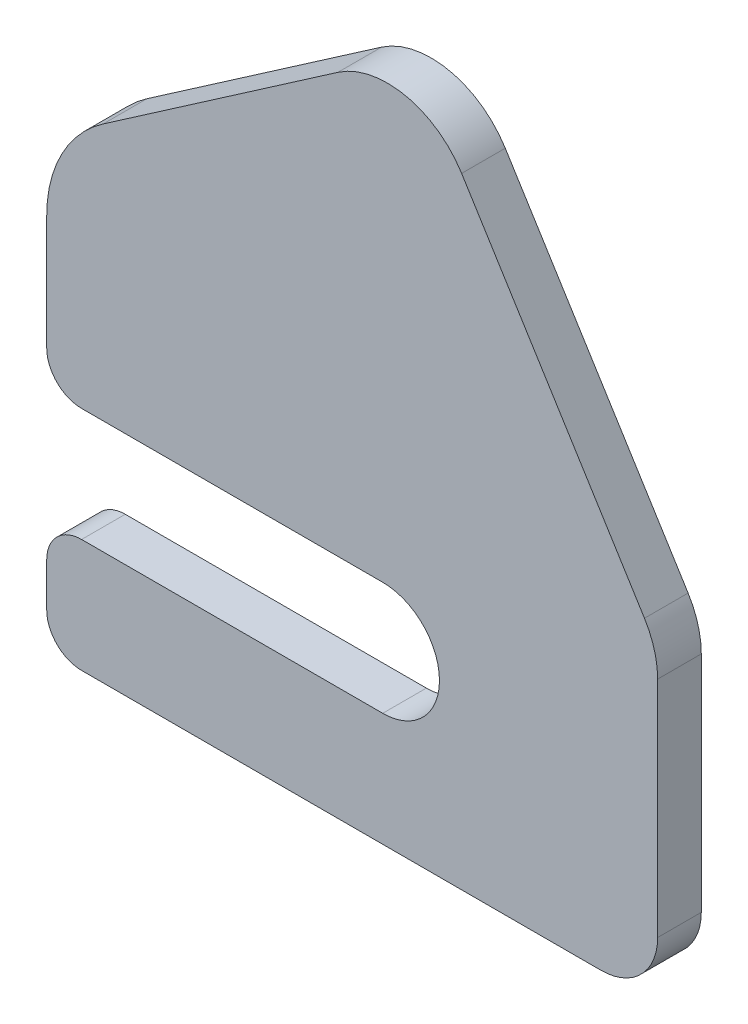
ISO-10303-21;
HEADER;
FILE_DESCRIPTION(('STEP AP214'),'2;1');
FILE_NAME('part.step','',(''),(''),'','','');
FILE_SCHEMA(('AUTOMOTIVE_DESIGN { 1 0 10303 214 1 1 1 1 }'));
ENDSEC;
DATA;
#1=APPLICATION_CONTEXT('core data for automotive mechanical design processes');
#2=APPLICATION_PROTOCOL_DEFINITION('international standard','automotive_design',2000,#1);
#3=PRODUCT_CONTEXT('',#1,'mechanical');
#4=PRODUCT('Part','Part','',(#3));
#5=PRODUCT_RELATED_PRODUCT_CATEGORY('part','',(#4));
#6=PRODUCT_DEFINITION_FORMATION('','',#4);
#7=PRODUCT_DEFINITION_CONTEXT('part definition',#1,'design');
#8=PRODUCT_DEFINITION('design','',#6,#7);
#9=PRODUCT_DEFINITION_SHAPE('','',#8);
#10=(LENGTH_UNIT() NAMED_UNIT(*) SI_UNIT(.MILLI.,.METRE.));
#11=(NAMED_UNIT(*) PLANE_ANGLE_UNIT() SI_UNIT($,.RADIAN.));
#12=(NAMED_UNIT(*) SI_UNIT($,.STERADIAN.) SOLID_ANGLE_UNIT());
#13=UNCERTAINTY_MEASURE_WITH_UNIT(LENGTH_MEASURE(1.E-05),#10,'distance_accuracy_value','');
#14=(GEOMETRIC_REPRESENTATION_CONTEXT(3) GLOBAL_UNCERTAINTY_ASSIGNED_CONTEXT((#13)) GLOBAL_UNIT_ASSIGNED_CONTEXT((#10,
#11,#12)) REPRESENTATION_CONTEXT('',''));
#15=CARTESIAN_POINT('',(0.,0.,0.));
#16=DIRECTION('',(0.,0.,1.));
#17=DIRECTION('',(1.,0.,0.));
#18=AXIS2_PLACEMENT_3D('',#15,#16,#17);
#19=CARTESIAN_POINT('',(0.,13.,5.));
#20=DIRECTION('',(1.,0.,0.));
#21=DIRECTION('',(0.,1.,0.));
#22=AXIS2_PLACEMENT_3D('',#19,#20,#21);
#23=PLANE('',#22);
#24=DIRECTION('',(0.,-1.,0.));
#25=VECTOR('',#24,1.);
#26=CARTESIAN_POINT('',(0.,13.,5.));
#27=LINE('',#26,#25);
#28=CARTESIAN_POINT('',(0.,9.,5.));
#29=VERTEX_POINT('',#28);
#30=CARTESIAN_POINT('',(0.,4.,5.));
#31=VERTEX_POINT('',#30);
#32=EDGE_CURVE('E188',#29,#31,#27,.T.);
#33=ORIENTED_EDGE('',*,*,#32,.F.);
#34=DIRECTION('',(0.,0.,-1.));
#35=VECTOR('',#34,1.);
#36=CARTESIAN_POINT('',(0.,9.,5.));
#37=LINE('',#36,#35);
#38=CARTESIAN_POINT('',(0.,9.,0.));
#39=VERTEX_POINT('',#38);
#40=EDGE_CURVE('E305',#29,#39,#37,.T.);
#41=ORIENTED_EDGE('',*,*,#40,.T.);
#42=DIRECTION('',(0.,-1.,0.));
#43=VECTOR('',#42,1.);
#44=CARTESIAN_POINT('',(0.,13.,0.));
#45=LINE('',#44,#43);
#46=CARTESIAN_POINT('',(0.,4.,0.));
#47=VERTEX_POINT('',#46);
#48=EDGE_CURVE('E269',#39,#47,#45,.T.);
#49=ORIENTED_EDGE('',*,*,#48,.T.);
#50=DIRECTION('',(0.,0.,-1.));
#51=VECTOR('',#50,1.);
#52=CARTESIAN_POINT('',(0.,4.,5.));
#53=LINE('',#52,#51);
#54=EDGE_CURVE('E303',#47,#31,#53,.F.);
#55=ORIENTED_EDGE('',*,*,#54,.T.);
#56=EDGE_LOOP('',(#33,#41,#49,#55));
#57=FACE_BOUND('',#56,.T.);
#58=ADVANCED_FACE('F38',(#57),#23,.F.);
#59=CARTESIAN_POINT('',(0.,0.,5.));
#60=DIRECTION('',(0.,1.,0.));
#61=DIRECTION('',(0.,0.,1.));
#62=AXIS2_PLACEMENT_3D('',#59,#60,#61);
#63=PLANE('',#62);
#64=DIRECTION('',(1.,0.,0.));
#65=VECTOR('',#64,1.);
#66=CARTESIAN_POINT('',(0.,0.,0.));
#67=LINE('',#66,#65);
#68=CARTESIAN_POINT('',(4.,0.,0.));
#69=VERTEX_POINT('',#68);
#70=CARTESIAN_POINT('',(63.5,0.,0.));
#71=VERTEX_POINT('',#70);
#72=EDGE_CURVE('E338',#69,#71,#67,.T.);
#73=ORIENTED_EDGE('',*,*,#72,.T.);
#74=DIRECTION('',(0.,0.,-1.));
#75=VECTOR('',#74,1.);
#76=CARTESIAN_POINT('',(63.5,0.,5.));
#77=LINE('',#76,#75);
#78=CARTESIAN_POINT('',(63.5,0.,5.));
#79=VERTEX_POINT('',#78);
#80=EDGE_CURVE('E247',#71,#79,#77,.F.);
#81=ORIENTED_EDGE('',*,*,#80,.T.);
#82=DIRECTION('',(1.,0.,0.));
#83=VECTOR('',#82,1.);
#84=CARTESIAN_POINT('',(0.,0.,5.));
#85=LINE('',#84,#83);
#86=CARTESIAN_POINT('',(4.,0.,5.));
#87=VERTEX_POINT('',#86);
#88=EDGE_CURVE('E214',#87,#79,#85,.T.);
#89=ORIENTED_EDGE('',*,*,#88,.F.);
#90=DIRECTION('',(0.,0.,-1.));
#91=VECTOR('',#90,1.);
#92=CARTESIAN_POINT('',(4.,0.,5.));
#93=LINE('',#92,#91);
#94=EDGE_CURVE('E311',#87,#69,#93,.T.);
#95=ORIENTED_EDGE('',*,*,#94,.T.);
#96=EDGE_LOOP('',(#73,#81,#89,#95));
#97=FACE_BOUND('',#96,.T.);
#98=ADVANCED_FACE('F365',(#97),#63,.F.);
#99=CARTESIAN_POINT('',(70.,0.,5.));
#100=DIRECTION('',(-1.,0.,0.));
#101=DIRECTION('',(0.,0.,1.));
#102=AXIS2_PLACEMENT_3D('',#99,#100,#101);
#103=PLANE('',#102);
#104=DIRECTION('',(0.,1.,0.));
#105=VECTOR('',#104,1.);
#106=CARTESIAN_POINT('',(70.,0.,5.));
#107=LINE('',#106,#105);
#108=CARTESIAN_POINT('',(70.,6.5,5.));
#109=VERTEX_POINT('',#108);
#110=CARTESIAN_POINT('',(70.,32.1428571428572,5.));
#111=VERTEX_POINT('',#110);
#112=EDGE_CURVE('E219',#109,#111,#107,.T.);
#113=ORIENTED_EDGE('',*,*,#112,.F.);
#114=DIRECTION('',(0.,0.,-1.));
#115=VECTOR('',#114,1.);
#116=CARTESIAN_POINT('',(70.,6.5,5.));
#117=LINE('',#116,#115);
#118=CARTESIAN_POINT('',(70.,6.5,0.));
#119=VERTEX_POINT('',#118);
#120=EDGE_CURVE('E242',#109,#119,#117,.T.);
#121=ORIENTED_EDGE('',*,*,#120,.T.);
#122=DIRECTION('',(0.,1.,0.));
#123=VECTOR('',#122,1.);
#124=CARTESIAN_POINT('',(70.,0.,0.));
#125=LINE('',#124,#123);
#126=CARTESIAN_POINT('',(70.,32.1428571428572,0.));
#127=VERTEX_POINT('',#126);
#128=EDGE_CURVE('E334',#119,#127,#125,.T.);
#129=ORIENTED_EDGE('',*,*,#128,.T.);
#130=DIRECTION('',(0.,0.,-1.));
#131=VECTOR('',#130,1.);
#132=CARTESIAN_POINT('',(70.,32.1428571428572,5.));
#133=LINE('',#132,#131);
#134=EDGE_CURVE('E239',#127,#111,#133,.F.);
#135=ORIENTED_EDGE('',*,*,#134,.T.);
#136=EDGE_LOOP('',(#113,#121,#129,#135));
#137=FACE_BOUND('',#136,.T.);
#138=ADVANCED_FACE('F371',(#137),#103,.F.);
#139=CARTESIAN_POINT('',(70.,35.,5.));
#140=DIRECTION('',(-0.849056603773585,-0.528301886792453,0.));
#141=DIRECTION('',(0.528301886792453,-0.849056603773585,0.));
#142=AXIS2_PLACEMENT_3D('',#139,#140,#141);
#143=PLANE('',#142);
#144=DIRECTION('',(-0.528301886792453,0.849056603773585,0.));
#145=VECTOR('',#144,1.);
#146=CARTESIAN_POINT('',(70.,35.,0.));
#147=LINE('',#146,#145);
#148=CARTESIAN_POINT('',(68.4905660377359,37.4258760107817,0.));
#149=VERTEX_POINT('',#148);
#150=CARTESIAN_POINT('',(47.5412604025752,71.0944029244328,0.));
#151=VERTEX_POINT('',#150);
#152=EDGE_CURVE('E329',#149,#151,#147,.T.);
#153=ORIENTED_EDGE('',*,*,#152,.T.);
#154=DIRECTION('',(0.,0.,-1.));
#155=VECTOR('',#154,1.);
#156=CARTESIAN_POINT('',(47.5412604025752,71.0944029244328,5.));
#157=LINE('',#156,#155);
#158=CARTESIAN_POINT('',(47.5412604025752,71.0944029244328,5.));
#159=VERTEX_POINT('',#158);
#160=EDGE_CURVE('E234',#151,#159,#157,.F.);
#161=ORIENTED_EDGE('',*,*,#160,.T.);
#162=DIRECTION('',(-0.528301886792453,0.849056603773585,0.));
#163=VECTOR('',#162,1.);
#164=CARTESIAN_POINT('',(70.,35.,5.));
#165=LINE('',#164,#163);
#166=CARTESIAN_POINT('',(68.4905660377359,37.4258760107817,5.));
#167=VERTEX_POINT('',#166);
#168=EDGE_CURVE('E224',#167,#159,#165,.T.);
#169=ORIENTED_EDGE('',*,*,#168,.F.);
#170=DIRECTION('',(0.,0.,-1.));
#171=VECTOR('',#170,1.);
#172=CARTESIAN_POINT('',(68.4905660377359,37.4258760107817,5.));
#173=LINE('',#172,#171);
#174=EDGE_CURVE('E320',#167,#149,#173,.T.);
#175=ORIENTED_EDGE('',*,*,#174,.T.);
#176=EDGE_LOOP('',(#153,#161,#169,#175));
#177=FACE_BOUND('',#176,.T.);
#178=ADVANCED_FACE('F328',(#177),#143,.F.);
#179=CARTESIAN_POINT('',(42.,80.,5.));
#180=DIRECTION('',(0.568190717082642,-0.822896900602447,0.));
#181=DIRECTION('',(0.822896900602447,0.568190717082642,0.));
#182=AXIS2_PLACEMENT_3D('',#179,#180,#181);
#183=PLANE('',#182);
#184=DIRECTION('',(-0.822896900602447,-0.568190717082642,0.));
#185=VECTOR('',#184,1.);
#186=CARTESIAN_POINT('',(42.,80.,0.));
#187=LINE('',#186,#185);
#188=CARTESIAN_POINT('',(33.3687871940129,74.0403530625327,0.));
#189=VERTEX_POINT('',#188);
#190=CARTESIAN_POINT('',(6.47713924376038,55.4723104302155,0.));
#191=VERTEX_POINT('',#190);
#192=EDGE_CURVE('E190',#189,#191,#187,.T.);
#193=ORIENTED_EDGE('',*,*,#192,.T.);
#194=DIRECTION('',(0.,0.,-1.));
#195=VECTOR('',#194,1.);
#196=CARTESIAN_POINT('',(6.47713924376037,55.4723104302155,5.));
#197=LINE('',#196,#195);
#198=CARTESIAN_POINT('',(6.47713924376038,55.4723104302155,5.));
#199=VERTEX_POINT('',#198);
#200=EDGE_CURVE('E48',#191,#199,#197,.F.);
#201=ORIENTED_EDGE('',*,*,#200,.T.);
#202=DIRECTION('',(-0.822896900602447,-0.568190717082642,0.));
#203=VECTOR('',#202,1.);
#204=CARTESIAN_POINT('',(42.,80.,5.));
#205=LINE('',#204,#203);
#206=CARTESIAN_POINT('',(33.3687871940129,74.0403530625327,5.));
#207=VERTEX_POINT('',#206);
#208=EDGE_CURVE('E281',#207,#199,#205,.T.);
#209=ORIENTED_EDGE('',*,*,#208,.F.);
#210=DIRECTION('',(0.,0.,-1.));
#211=VECTOR('',#210,1.);
#212=CARTESIAN_POINT('',(33.3687871940129,74.0403530625327,5.));
#213=LINE('',#212,#211);
#214=EDGE_CURVE('E314',#207,#189,#213,.T.);
#215=ORIENTED_EDGE('',*,*,#214,.T.);
#216=EDGE_LOOP('',(#193,#201,#209,#215));
#217=FACE_BOUND('',#216,.T.);
#218=ADVANCED_FACE('F333',(#217),#183,.F.);
#219=CARTESIAN_POINT('',(0.,51.,5.));
#220=DIRECTION('',(1.,0.,0.));
#221=DIRECTION('',(0.,1.,0.));
#222=AXIS2_PLACEMENT_3D('',#219,#220,#221);
#223=PLANE('',#222);
#224=DIRECTION('',(0.,-1.,0.));
#225=VECTOR('',#224,1.);
#226=CARTESIAN_POINT('',(0.,51.,5.));
#227=LINE('',#226,#225);
#228=CARTESIAN_POINT('',(0.,43.1288569211788,5.));
#229=VERTEX_POINT('',#228);
#230=CARTESIAN_POINT('',(0.,30.,5.));
#231=VERTEX_POINT('',#230);
#232=EDGE_CURVE('E276',#229,#231,#227,.T.);
#233=ORIENTED_EDGE('',*,*,#232,.F.);
#234=DIRECTION('',(0.,0.,-1.));
#235=VECTOR('',#234,1.);
#236=CARTESIAN_POINT('',(0.,43.1288569211788,5.));
#237=LINE('',#236,#235);
#238=CARTESIAN_POINT('',(0.,43.1288569211788,0.));
#239=VERTEX_POINT('',#238);
#240=EDGE_CURVE('E265',#229,#239,#237,.T.);
#241=ORIENTED_EDGE('',*,*,#240,.T.);
#242=DIRECTION('',(0.,-1.,0.));
#243=VECTOR('',#242,1.);
#244=CARTESIAN_POINT('',(0.,51.,0.));
#245=LINE('',#244,#243);
#246=CARTESIAN_POINT('',(0.,30.,0.));
#247=VERTEX_POINT('',#246);
#248=EDGE_CURVE('E186',#239,#247,#245,.T.);
#249=ORIENTED_EDGE('',*,*,#248,.T.);
#250=DIRECTION('',(0.,0.,-1.));
#251=VECTOR('',#250,1.);
#252=CARTESIAN_POINT('',(0.,30.,5.));
#253=LINE('',#252,#251);
#254=EDGE_CURVE('E166',#247,#231,#253,.F.);
#255=ORIENTED_EDGE('',*,*,#254,.T.);
#256=EDGE_LOOP('',(#233,#241,#249,#255));
#257=FACE_BOUND('',#256,.T.);
#258=ADVANCED_FACE('F275',(#257),#223,.F.);
#259=CARTESIAN_POINT('',(0.,26.,5.));
#260=DIRECTION('',(0.,1.,0.));
#261=DIRECTION('',(0.,0.,1.));
#262=AXIS2_PLACEMENT_3D('',#259,#260,#261);
#263=PLANE('',#262);
#264=DIRECTION('',(1.,0.,0.));
#265=VECTOR('',#264,1.);
#266=CARTESIAN_POINT('',(0.,26.,0.));
#267=LINE('',#266,#265);
#268=CARTESIAN_POINT('',(4.,26.,0.));
#269=VERTEX_POINT('',#268);
#270=CARTESIAN_POINT('',(38.5,26.,0.));
#271=VERTEX_POINT('',#270);
#272=EDGE_CURVE('E175',#269,#271,#267,.T.);
#273=ORIENTED_EDGE('',*,*,#272,.T.);
#274=DIRECTION('',(0.,0.,-1.));
#275=VECTOR('',#274,1.);
#276=CARTESIAN_POINT('',(38.5,26.,5.));
#277=LINE('',#276,#275);
#278=CARTESIAN_POINT('',(38.5,26.,5.));
#279=VERTEX_POINT('',#278);
#280=EDGE_CURVE('E252',#271,#279,#277,.F.);
#281=ORIENTED_EDGE('',*,*,#280,.T.);
#282=DIRECTION('',(1.,0.,0.));
#283=VECTOR('',#282,1.);
#284=CARTESIAN_POINT('',(0.,26.,5.));
#285=LINE('',#284,#283);
#286=CARTESIAN_POINT('',(4.,26.,5.));
#287=VERTEX_POINT('',#286);
#288=EDGE_CURVE('E178',#287,#279,#285,.T.);
#289=ORIENTED_EDGE('',*,*,#288,.F.);
#290=DIRECTION('',(0.,0.,-1.));
#291=VECTOR('',#290,1.);
#292=CARTESIAN_POINT('',(4.,26.,5.));
#293=LINE('',#292,#291);
#294=EDGE_CURVE('E164',#287,#269,#293,.T.);
#295=ORIENTED_EDGE('',*,*,#294,.T.);
#296=EDGE_LOOP('',(#273,#281,#289,#295));
#297=FACE_BOUND('',#296,.T.);
#298=ADVANCED_FACE('F173',(#297),#263,.F.);
#299=CARTESIAN_POINT('',(45.,13.,5.));
#300=DIRECTION('',(0.,-1.,0.));
#301=DIRECTION('',(1.,0.,0.));
#302=AXIS2_PLACEMENT_3D('',#299,#300,#301);
#303=PLANE('',#302);
#304=DIRECTION('',(-1.,0.,0.));
#305=VECTOR('',#304,1.);
#306=CARTESIAN_POINT('',(45.,13.,5.));
#307=LINE('',#306,#305);
#308=CARTESIAN_POINT('',(38.5,13.,5.));
#309=VERTEX_POINT('',#308);
#310=CARTESIAN_POINT('',(4.00000000000001,13.,5.));
#311=VERTEX_POINT('',#310);
#312=EDGE_CURVE('E180',#309,#311,#307,.T.);
#313=ORIENTED_EDGE('',*,*,#312,.F.);
#314=DIRECTION('',(0.,0.,-1.));
#315=VECTOR('',#314,1.);
#316=CARTESIAN_POINT('',(38.5,13.,0.));
#317=LINE('',#316,#315);
#318=CARTESIAN_POINT('',(38.5,13.,0.));
#319=VERTEX_POINT('',#318);
#320=EDGE_CURVE('E254',#309,#319,#317,.T.);
#321=ORIENTED_EDGE('',*,*,#320,.T.);
#322=DIRECTION('',(-1.,0.,0.));
#323=VECTOR('',#322,1.);
#324=CARTESIAN_POINT('',(45.,13.,0.));
#325=LINE('',#324,#323);
#326=CARTESIAN_POINT('',(4.00000000000001,13.,0.));
#327=VERTEX_POINT('',#326);
#328=EDGE_CURVE('E185',#319,#327,#325,.T.);
#329=ORIENTED_EDGE('',*,*,#328,.T.);
#330=DIRECTION('',(0.,0.,-1.));
#331=VECTOR('',#330,1.);
#332=CARTESIAN_POINT('',(4.,13.,5.));
#333=LINE('',#332,#331);
#334=EDGE_CURVE('E308',#327,#311,#333,.F.);
#335=ORIENTED_EDGE('',*,*,#334,.T.);
#336=EDGE_LOOP('',(#313,#321,#329,#335));
#337=FACE_BOUND('',#336,.T.);
#338=ADVANCED_FACE('F415',(#337),#303,.F.);
#339=CARTESIAN_POINT('',(0.,0.,5.));
#340=DIRECTION('',(0.,0.,1.));
#341=DIRECTION('',(1.,0.,0.));
#342=AXIS2_PLACEMENT_3D('',#339,#340,#341);
#343=PLANE('',#342);
#344=ORIENTED_EDGE('',*,*,#208,.T.);
#345=CARTESIAN_POINT('',(15.,43.1288569211788,5.));
#346=DIRECTION('',(0.,0.,1.));
#347=DIRECTION('',(1.,0.,0.));
#348=AXIS2_PLACEMENT_3D('',#345,#346,#347);
#349=CIRCLE('',#348,15.);
#350=EDGE_CURVE('E12',#199,#229,#349,.T.);
#351=ORIENTED_EDGE('',*,*,#350,.T.);
#352=ORIENTED_EDGE('',*,*,#232,.T.);
#353=CARTESIAN_POINT('',(4.,30.,5.));
#354=DIRECTION('',(0.,0.,1.));
#355=DIRECTION('',(1.,0.,0.));
#356=AXIS2_PLACEMENT_3D('',#353,#354,#355);
#357=CIRCLE('',#356,4.);
#358=EDGE_CURVE('E299',#231,#287,#357,.T.);
#359=ORIENTED_EDGE('',*,*,#358,.T.);
#360=ORIENTED_EDGE('',*,*,#288,.T.);
#361=CARTESIAN_POINT('',(38.5,19.5,5.));
#362=DIRECTION('',(0.,0.,1.));
#363=DIRECTION('',(1.,0.,0.));
#364=AXIS2_PLACEMENT_3D('',#361,#362,#363);
#365=CIRCLE('',#364,6.5);
#366=CARTESIAN_POINT('',(45.,19.5,5.));
#367=VERTEX_POINT('',#366);
#368=EDGE_CURVE('E257',#279,#367,#365,.F.);
#369=ORIENTED_EDGE('',*,*,#368,.T.);
#370=CARTESIAN_POINT('',(38.5,19.5,5.));
#371=DIRECTION('',(0.,0.,1.));
#372=DIRECTION('',(1.,0.,0.));
#373=AXIS2_PLACEMENT_3D('',#370,#371,#372);
#374=CIRCLE('',#373,6.5);
#375=EDGE_CURVE('E262',#367,#309,#374,.F.);
#376=ORIENTED_EDGE('',*,*,#375,.T.);
#377=ORIENTED_EDGE('',*,*,#312,.T.);
#378=CARTESIAN_POINT('',(4.,9.,5.));
#379=DIRECTION('',(0.,0.,1.));
#380=DIRECTION('',(1.,0.,0.));
#381=AXIS2_PLACEMENT_3D('',#378,#379,#380);
#382=CIRCLE('',#381,4.);
#383=EDGE_CURVE('E202',#311,#29,#382,.T.);
#384=ORIENTED_EDGE('',*,*,#383,.T.);
#385=ORIENTED_EDGE('',*,*,#32,.T.);
#386=CARTESIAN_POINT('',(4.,4.,5.));
#387=DIRECTION('',(0.,0.,1.));
#388=DIRECTION('',(1.,0.,0.));
#389=AXIS2_PLACEMENT_3D('',#386,#387,#388);
#390=CIRCLE('',#389,4.);
#391=EDGE_CURVE('E198',#31,#87,#390,.T.);
#392=ORIENTED_EDGE('',*,*,#391,.T.);
#393=ORIENTED_EDGE('',*,*,#88,.T.);
#394=CARTESIAN_POINT('',(63.5,6.5,5.));
#395=DIRECTION('',(0.,0.,1.));
#396=DIRECTION('',(1.,0.,0.));
#397=AXIS2_PLACEMENT_3D('',#394,#395,#396);
#398=CIRCLE('',#397,6.5);
#399=EDGE_CURVE('E248',#79,#109,#398,.T.);
#400=ORIENTED_EDGE('',*,*,#399,.T.);
#401=ORIENTED_EDGE('',*,*,#112,.T.);
#402=CARTESIAN_POINT('',(60.,32.1428571428572,5.));
#403=DIRECTION('',(0.,0.,1.));
#404=DIRECTION('',(1.,0.,0.));
#405=AXIS2_PLACEMENT_3D('',#402,#403,#404);
#406=CIRCLE('',#405,10.);
#407=EDGE_CURVE('E229',#111,#167,#406,.T.);
#408=ORIENTED_EDGE('',*,*,#407,.T.);
#409=ORIENTED_EDGE('',*,*,#168,.T.);
#410=CARTESIAN_POINT('',(39.0506943648393,65.8113840565082,5.));
#411=DIRECTION('',(0.,0.,1.));
#412=DIRECTION('',(1.,0.,0.));
#413=AXIS2_PLACEMENT_3D('',#410,#411,#412);
#414=CIRCLE('',#413,10.);
#415=EDGE_CURVE('E233',#159,#207,#414,.T.);
#416=ORIENTED_EDGE('',*,*,#415,.T.);
#417=EDGE_LOOP('',(#344,#351,#352,#359,#360,#369,#376,#377,#384,#385,#392,#393,#400,#401,#408,
#409,#416));
#418=FACE_BOUND('',#417,.T.);
#419=ADVANCED_FACE('F280',(#418),#343,.T.);
#420=CARTESIAN_POINT('',(0.,0.,0.));
#421=DIRECTION('',(0.,0.,1.));
#422=DIRECTION('',(1.,0.,0.));
#423=AXIS2_PLACEMENT_3D('',#420,#421,#422);
#424=PLANE('',#423);
#425=ORIENTED_EDGE('',*,*,#248,.F.);
#426=CARTESIAN_POINT('',(15.,43.1288569211788,0.));
#427=DIRECTION('',(0.,0.,1.));
#428=DIRECTION('',(1.,0.,0.));
#429=AXIS2_PLACEMENT_3D('',#426,#427,#428);
#430=CIRCLE('',#429,15.);
#431=EDGE_CURVE('E62',#239,#191,#430,.F.);
#432=ORIENTED_EDGE('',*,*,#431,.T.);
#433=ORIENTED_EDGE('',*,*,#192,.F.);
#434=CARTESIAN_POINT('',(39.0506943648393,65.8113840565082,0.));
#435=DIRECTION('',(0.,0.,1.));
#436=DIRECTION('',(1.,0.,0.));
#437=AXIS2_PLACEMENT_3D('',#434,#435,#436);
#438=CIRCLE('',#437,10.);
#439=EDGE_CURVE('E319',#189,#151,#438,.F.);
#440=ORIENTED_EDGE('',*,*,#439,.T.);
#441=ORIENTED_EDGE('',*,*,#152,.F.);
#442=CARTESIAN_POINT('',(60.,32.1428571428572,0.));
#443=DIRECTION('',(0.,0.,1.));
#444=DIRECTION('',(1.,0.,0.));
#445=AXIS2_PLACEMENT_3D('',#442,#443,#444);
#446=CIRCLE('',#445,10.);
#447=EDGE_CURVE('E316',#149,#127,#446,.F.);
#448=ORIENTED_EDGE('',*,*,#447,.T.);
#449=ORIENTED_EDGE('',*,*,#128,.F.);
#450=CARTESIAN_POINT('',(63.5,6.5,0.));
#451=DIRECTION('',(0.,0.,1.));
#452=DIRECTION('',(1.,0.,0.));
#453=AXIS2_PLACEMENT_3D('',#450,#451,#452);
#454=CIRCLE('',#453,6.5);
#455=EDGE_CURVE('E245',#119,#71,#454,.F.);
#456=ORIENTED_EDGE('',*,*,#455,.T.);
#457=ORIENTED_EDGE('',*,*,#72,.F.);
#458=CARTESIAN_POINT('',(4.,4.,0.));
#459=DIRECTION('',(0.,0.,1.));
#460=DIRECTION('',(1.,0.,0.));
#461=AXIS2_PLACEMENT_3D('',#458,#459,#460);
#462=CIRCLE('',#461,4.);
#463=EDGE_CURVE('E179',#69,#47,#462,.F.);
#464=ORIENTED_EDGE('',*,*,#463,.T.);
#465=ORIENTED_EDGE('',*,*,#48,.F.);
#466=CARTESIAN_POINT('',(4.,9.,0.));
#467=DIRECTION('',(0.,0.,1.));
#468=DIRECTION('',(1.,0.,0.));
#469=AXIS2_PLACEMENT_3D('',#466,#467,#468);
#470=CIRCLE('',#469,4.);
#471=EDGE_CURVE('E168',#39,#327,#470,.F.);
#472=ORIENTED_EDGE('',*,*,#471,.T.);
#473=ORIENTED_EDGE('',*,*,#328,.F.);
#474=CARTESIAN_POINT('',(38.5,19.5,0.));
#475=DIRECTION('',(0.,0.,1.));
#476=DIRECTION('',(1.,0.,0.));
#477=AXIS2_PLACEMENT_3D('',#474,#475,#476);
#478=CIRCLE('',#477,6.5);
#479=CARTESIAN_POINT('',(45.,19.5,0.));
#480=VERTEX_POINT('',#479);
#481=EDGE_CURVE('E260',#319,#480,#478,.T.);
#482=ORIENTED_EDGE('',*,*,#481,.T.);
#483=CARTESIAN_POINT('',(38.5,19.5,0.));
#484=DIRECTION('',(0.,0.,1.));
#485=DIRECTION('',(1.,0.,0.));
#486=AXIS2_PLACEMENT_3D('',#483,#484,#485);
#487=CIRCLE('',#486,6.5);
#488=EDGE_CURVE('E184',#480,#271,#487,.T.);
#489=ORIENTED_EDGE('',*,*,#488,.T.);
#490=ORIENTED_EDGE('',*,*,#272,.F.);
#491=CARTESIAN_POINT('',(4.,30.,0.));
#492=DIRECTION('',(0.,0.,1.));
#493=DIRECTION('',(1.,0.,0.));
#494=AXIS2_PLACEMENT_3D('',#491,#492,#493);
#495=CIRCLE('',#494,4.);
#496=EDGE_CURVE('E160',#269,#247,#495,.F.);
#497=ORIENTED_EDGE('',*,*,#496,.T.);
#498=EDGE_LOOP('',(#425,#432,#433,#440,#441,#448,#449,#456,#457,#464,#465,#472,#473,#482,#489,
#490,#497));
#499=FACE_BOUND('',#498,.T.);
#500=ADVANCED_FACE('F182',(#499),#424,.F.);
#501=CARTESIAN_POINT('',(4.,30.,5.));
#502=DIRECTION('',(0.,0.,-1.));
#503=DIRECTION('',(-1.,0.,0.));
#504=AXIS2_PLACEMENT_3D('',#501,#502,#503);
#505=CYLINDRICAL_SURFACE('',#504,4.);
#506=ORIENTED_EDGE('',*,*,#358,.F.);
#507=ORIENTED_EDGE('',*,*,#254,.F.);
#508=ORIENTED_EDGE('',*,*,#496,.F.);
#509=ORIENTED_EDGE('',*,*,#294,.F.);
#510=EDGE_LOOP('',(#506,#507,#508,#509));
#511=FACE_BOUND('',#510,.T.);
#512=ADVANCED_FACE('F163',(#511),#505,.T.);
#513=CARTESIAN_POINT('',(4.,9.,5.));
#514=DIRECTION('',(0.,0.,-1.));
#515=DIRECTION('',(-1.,0.,0.));
#516=AXIS2_PLACEMENT_3D('',#513,#514,#515);
#517=CYLINDRICAL_SURFACE('',#516,4.);
#518=ORIENTED_EDGE('',*,*,#383,.F.);
#519=ORIENTED_EDGE('',*,*,#334,.F.);
#520=ORIENTED_EDGE('',*,*,#471,.F.);
#521=ORIENTED_EDGE('',*,*,#40,.F.);
#522=EDGE_LOOP('',(#518,#519,#520,#521));
#523=FACE_BOUND('',#522,.T.);
#524=ADVANCED_FACE('F379',(#523),#517,.T.);
#525=CARTESIAN_POINT('',(4.,4.,5.));
#526=DIRECTION('',(0.,0.,-1.));
#527=DIRECTION('',(-1.,0.,0.));
#528=AXIS2_PLACEMENT_3D('',#525,#526,#527);
#529=CYLINDRICAL_SURFACE('',#528,4.);
#530=ORIENTED_EDGE('',*,*,#391,.F.);
#531=ORIENTED_EDGE('',*,*,#54,.F.);
#532=ORIENTED_EDGE('',*,*,#463,.F.);
#533=ORIENTED_EDGE('',*,*,#94,.F.);
#534=EDGE_LOOP('',(#530,#531,#532,#533));
#535=FACE_BOUND('',#534,.T.);
#536=ADVANCED_FACE('F382',(#535),#529,.T.);
#537=CARTESIAN_POINT('',(39.0506943648393,65.8113840565082,5.));
#538=DIRECTION('',(0.,0.,-1.));
#539=DIRECTION('',(-1.,0.,0.));
#540=AXIS2_PLACEMENT_3D('',#537,#538,#539);
#541=CYLINDRICAL_SURFACE('',#540,10.);
#542=ORIENTED_EDGE('',*,*,#415,.F.);
#543=ORIENTED_EDGE('',*,*,#160,.F.);
#544=ORIENTED_EDGE('',*,*,#439,.F.);
#545=ORIENTED_EDGE('',*,*,#214,.F.);
#546=EDGE_LOOP('',(#542,#543,#544,#545));
#547=FACE_BOUND('',#546,.T.);
#548=ADVANCED_FACE('F332',(#547),#541,.T.);
#549=CARTESIAN_POINT('',(60.,32.1428571428572,5.));
#550=DIRECTION('',(0.,0.,-1.));
#551=DIRECTION('',(-1.,0.,0.));
#552=AXIS2_PLACEMENT_3D('',#549,#550,#551);
#553=CYLINDRICAL_SURFACE('',#552,10.);
#554=ORIENTED_EDGE('',*,*,#407,.F.);
#555=ORIENTED_EDGE('',*,*,#134,.F.);
#556=ORIENTED_EDGE('',*,*,#447,.F.);
#557=ORIENTED_EDGE('',*,*,#174,.F.);
#558=EDGE_LOOP('',(#554,#555,#556,#557));
#559=FACE_BOUND('',#558,.T.);
#560=ADVANCED_FACE('F389',(#559),#553,.T.);
#561=CARTESIAN_POINT('',(63.5,6.5,5.));
#562=DIRECTION('',(0.,0.,-1.));
#563=DIRECTION('',(-1.,0.,0.));
#564=AXIS2_PLACEMENT_3D('',#561,#562,#563);
#565=CYLINDRICAL_SURFACE('',#564,6.5);
#566=ORIENTED_EDGE('',*,*,#399,.F.);
#567=ORIENTED_EDGE('',*,*,#80,.F.);
#568=ORIENTED_EDGE('',*,*,#455,.F.);
#569=ORIENTED_EDGE('',*,*,#120,.F.);
#570=EDGE_LOOP('',(#566,#567,#568,#569));
#571=FACE_BOUND('',#570,.T.);
#572=ADVANCED_FACE('F362',(#571),#565,.T.);
#573=CARTESIAN_POINT('',(38.5,19.5,5.));
#574=DIRECTION('',(0.,0.,1.));
#575=DIRECTION('',(1.,0.,0.));
#576=AXIS2_PLACEMENT_3D('',#573,#574,#575);
#577=CYLINDRICAL_SURFACE('',#576,6.5);
#578=ORIENTED_EDGE('',*,*,#320,.F.);
#579=ORIENTED_EDGE('',*,*,#375,.F.);
#580=DIRECTION('',(0.,0.,-1.));
#581=VECTOR('',#580,1.);
#582=CARTESIAN_POINT('',(45.,19.5,5.));
#583=LINE('',#582,#581);
#584=EDGE_CURVE('E266',#480,#367,#583,.F.);
#585=ORIENTED_EDGE('',*,*,#584,.F.);
#586=ORIENTED_EDGE('',*,*,#481,.F.);
#587=EDGE_LOOP('',(#578,#579,#585,#586));
#588=FACE_BOUND('',#587,.T.);
#589=ADVANCED_FACE('F353',(#588),#577,.F.);
#590=CARTESIAN_POINT('',(38.5,19.5,5.));
#591=DIRECTION('',(0.,0.,1.));
#592=DIRECTION('',(1.,0.,0.));
#593=AXIS2_PLACEMENT_3D('',#590,#591,#592);
#594=CYLINDRICAL_SURFACE('',#593,6.5);
#595=ORIENTED_EDGE('',*,*,#368,.F.);
#596=ORIENTED_EDGE('',*,*,#280,.F.);
#597=ORIENTED_EDGE('',*,*,#488,.F.);
#598=ORIENTED_EDGE('',*,*,#584,.T.);
#599=EDGE_LOOP('',(#595,#596,#597,#598));
#600=FACE_BOUND('',#599,.T.);
#601=ADVANCED_FACE('F355',(#600),#594,.F.);
#602=CARTESIAN_POINT('',(15.,43.1288569211788,5.));
#603=DIRECTION('',(0.,0.,-1.));
#604=DIRECTION('',(-1.,0.,0.));
#605=AXIS2_PLACEMENT_3D('',#602,#603,#604);
#606=CYLINDRICAL_SURFACE('',#605,15.);
#607=ORIENTED_EDGE('',*,*,#350,.F.);
#608=ORIENTED_EDGE('',*,*,#200,.F.);
#609=ORIENTED_EDGE('',*,*,#431,.F.);
#610=ORIENTED_EDGE('',*,*,#240,.F.);
#611=EDGE_LOOP('',(#607,#608,#609,#610));
#612=FACE_BOUND('',#611,.T.);
#613=ADVANCED_FACE('F40',(#612),#606,.T.);
#614=CLOSED_SHELL('',(#58,#98,#138,#178,#218,#258,#298,#338,#419,#500,#512,#524,#536,#548,#560,
#572,#589,#601,#613));
#615=MANIFOLD_SOLID_BREP('B2',#614);
#616=ADVANCED_BREP_SHAPE_REPRESENTATION('',(#18,#615),#14);
#617=SHAPE_DEFINITION_REPRESENTATION(#9,#616);
ENDSEC;
END-ISO-10303-21;
